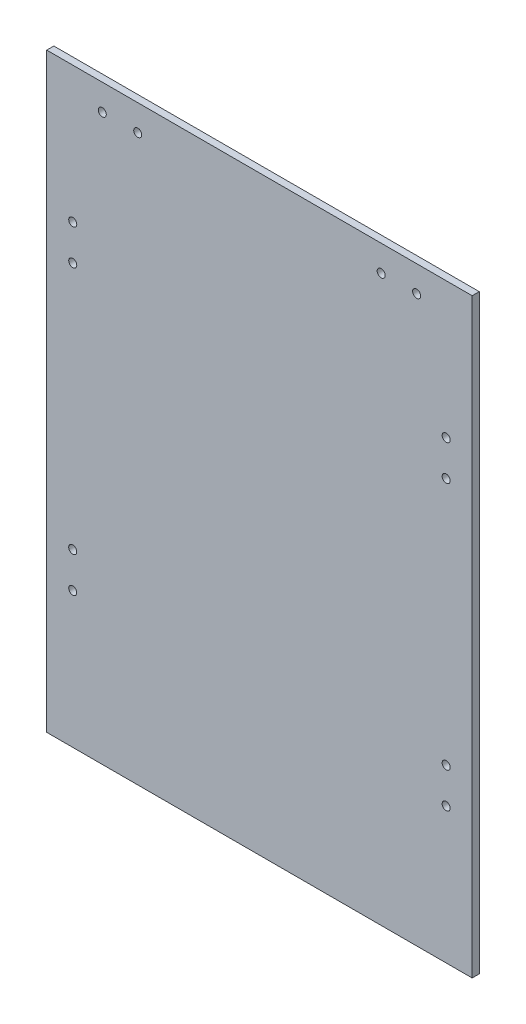
ISO-10303-21;
HEADER;
FILE_DESCRIPTION(('STEP AP214'),'2;1');
FILE_NAME('part.step','',(''),(''),'','','');
FILE_SCHEMA(('AUTOMOTIVE_DESIGN { 1 0 10303 214 1 1 1 1 }'));
ENDSEC;
DATA;
#1=APPLICATION_CONTEXT('core data for automotive mechanical design processes');
#2=APPLICATION_PROTOCOL_DEFINITION('international standard','automotive_design',2000,#1);
#3=PRODUCT_CONTEXT('',#1,'mechanical');
#4=PRODUCT('Part','Part','',(#3));
#5=PRODUCT_RELATED_PRODUCT_CATEGORY('part','',(#4));
#6=PRODUCT_DEFINITION_FORMATION('','',#4);
#7=PRODUCT_DEFINITION_CONTEXT('part definition',#1,'design');
#8=PRODUCT_DEFINITION('design','',#6,#7);
#9=PRODUCT_DEFINITION_SHAPE('','',#8);
#10=(LENGTH_UNIT() NAMED_UNIT(*) SI_UNIT(.MILLI.,.METRE.));
#11=(NAMED_UNIT(*) PLANE_ANGLE_UNIT() SI_UNIT($,.RADIAN.));
#12=(NAMED_UNIT(*) SI_UNIT($,.STERADIAN.) SOLID_ANGLE_UNIT());
#13=UNCERTAINTY_MEASURE_WITH_UNIT(LENGTH_MEASURE(1.E-05),#10,'distance_accuracy_value','');
#14=(GEOMETRIC_REPRESENTATION_CONTEXT(3) GLOBAL_UNCERTAINTY_ASSIGNED_CONTEXT((#13)) GLOBAL_UNIT_ASSIGNED_CONTEXT((#10,
#11,#12)) REPRESENTATION_CONTEXT('',''));
#15=CARTESIAN_POINT('',(0.,0.,0.));
#16=DIRECTION('',(0.,0.,1.));
#17=DIRECTION('',(1.,0.,0.));
#18=AXIS2_PLACEMENT_3D('',#15,#16,#17);
#19=CARTESIAN_POINT('',(-90.,-125.,1.5));
#20=DIRECTION('',(1.,0.,0.));
#21=DIRECTION('',(0.,0.,-1.));
#22=AXIS2_PLACEMENT_3D('',#19,#20,#21);
#23=PLANE('',#22);
#24=DIRECTION('',(0.,-1.,0.));
#25=VECTOR('',#24,1.);
#26=CARTESIAN_POINT('',(-90.,-125.,-1.5));
#27=LINE('',#26,#25);
#28=CARTESIAN_POINT('',(-90.,125.,-1.5));
#29=VERTEX_POINT('',#28);
#30=CARTESIAN_POINT('',(-90.,-125.,-1.5));
#31=VERTEX_POINT('',#30);
#32=EDGE_CURVE('E102',#29,#31,#27,.T.);
#33=ORIENTED_EDGE('',*,*,#32,.T.);
#34=DIRECTION('',(0.,0.,-1.));
#35=VECTOR('',#34,1.);
#36=CARTESIAN_POINT('',(-90.,-125.,1.5));
#37=LINE('',#36,#35);
#38=CARTESIAN_POINT('',(-90.,-125.,1.5));
#39=VERTEX_POINT('',#38);
#40=EDGE_CURVE('E11',#39,#31,#37,.T.);
#41=ORIENTED_EDGE('',*,*,#40,.F.);
#42=DIRECTION('',(0.,-1.,0.));
#43=VECTOR('',#42,1.);
#44=CARTESIAN_POINT('',(-90.,-125.,1.5));
#45=LINE('',#44,#43);
#46=CARTESIAN_POINT('',(-90.,125.,1.5));
#47=VERTEX_POINT('',#46);
#48=EDGE_CURVE('E90',#47,#39,#45,.T.);
#49=ORIENTED_EDGE('',*,*,#48,.F.);
#50=DIRECTION('',(0.,0.,-1.));
#51=VECTOR('',#50,1.);
#52=CARTESIAN_POINT('',(-90.,125.,1.5));
#53=LINE('',#52,#51);
#54=EDGE_CURVE('E98',#47,#29,#53,.T.);
#55=ORIENTED_EDGE('',*,*,#54,.T.);
#56=EDGE_LOOP('',(#33,#41,#49,#55));
#57=FACE_BOUND('',#56,.T.);
#58=ADVANCED_FACE('F39',(#57),#23,.F.);
#59=CARTESIAN_POINT('',(90.,-125.,1.5));
#60=DIRECTION('',(0.,1.,0.));
#61=DIRECTION('',(0.,0.,1.));
#62=AXIS2_PLACEMENT_3D('',#59,#60,#61);
#63=PLANE('',#62);
#64=DIRECTION('',(1.,0.,0.));
#65=VECTOR('',#64,1.);
#66=CARTESIAN_POINT('',(90.,-125.,-1.5));
#67=LINE('',#66,#65);
#68=CARTESIAN_POINT('',(90.,-125.,-1.5));
#69=VERTEX_POINT('',#68);
#70=EDGE_CURVE('E94',#31,#69,#67,.T.);
#71=ORIENTED_EDGE('',*,*,#70,.T.);
#72=DIRECTION('',(0.,0.,-1.));
#73=VECTOR('',#72,1.);
#74=CARTESIAN_POINT('',(90.,-125.,1.5));
#75=LINE('',#74,#73);
#76=CARTESIAN_POINT('',(90.,-125.,1.5));
#77=VERTEX_POINT('',#76);
#78=EDGE_CURVE('E47',#77,#69,#75,.T.);
#79=ORIENTED_EDGE('',*,*,#78,.F.);
#80=DIRECTION('',(1.,0.,0.));
#81=VECTOR('',#80,1.);
#82=CARTESIAN_POINT('',(90.,-125.,1.5));
#83=LINE('',#82,#81);
#84=EDGE_CURVE('E85',#39,#77,#83,.T.);
#85=ORIENTED_EDGE('',*,*,#84,.F.);
#86=ORIENTED_EDGE('',*,*,#40,.T.);
#87=EDGE_LOOP('',(#71,#79,#85,#86));
#88=FACE_BOUND('',#87,.T.);
#89=ADVANCED_FACE('F93',(#88),#63,.F.);
#90=CARTESIAN_POINT('',(90.,-125.,1.5));
#91=DIRECTION('',(-1.,0.,0.));
#92=DIRECTION('',(0.,-1.,0.));
#93=AXIS2_PLACEMENT_3D('',#90,#91,#92);
#94=PLANE('',#93);
#95=DIRECTION('',(0.,1.,0.));
#96=VECTOR('',#95,1.);
#97=CARTESIAN_POINT('',(90.,-125.,-1.5));
#98=LINE('',#97,#96);
#99=CARTESIAN_POINT('',(90.,125.,-1.5));
#100=VERTEX_POINT('',#99);
#101=EDGE_CURVE('E72',#69,#100,#98,.T.);
#102=ORIENTED_EDGE('',*,*,#101,.T.);
#103=DIRECTION('',(0.,0.,-1.));
#104=VECTOR('',#103,1.);
#105=CARTESIAN_POINT('',(90.,125.,1.5));
#106=LINE('',#105,#104);
#107=CARTESIAN_POINT('',(90.,125.,1.5));
#108=VERTEX_POINT('',#107);
#109=EDGE_CURVE('E95',#108,#100,#106,.T.);
#110=ORIENTED_EDGE('',*,*,#109,.F.);
#111=DIRECTION('',(0.,1.,0.));
#112=VECTOR('',#111,1.);
#113=CARTESIAN_POINT('',(90.,-125.,1.5));
#114=LINE('',#113,#112);
#115=EDGE_CURVE('E88',#77,#108,#114,.T.);
#116=ORIENTED_EDGE('',*,*,#115,.F.);
#117=ORIENTED_EDGE('',*,*,#78,.T.);
#118=EDGE_LOOP('',(#102,#110,#116,#117));
#119=FACE_BOUND('',#118,.T.);
#120=ADVANCED_FACE('F96',(#119),#94,.F.);
#121=CARTESIAN_POINT('',(90.,125.,1.5));
#122=DIRECTION('',(0.,-1.,0.));
#123=DIRECTION('',(1.,0.,0.));
#124=AXIS2_PLACEMENT_3D('',#121,#122,#123);
#125=PLANE('',#124);
#126=DIRECTION('',(-1.,0.,0.));
#127=VECTOR('',#126,1.);
#128=CARTESIAN_POINT('',(90.,125.,-1.5));
#129=LINE('',#128,#127);
#130=EDGE_CURVE('E78',#100,#29,#129,.T.);
#131=ORIENTED_EDGE('',*,*,#130,.T.);
#132=ORIENTED_EDGE('',*,*,#54,.F.);
#133=DIRECTION('',(-1.,0.,0.));
#134=VECTOR('',#133,1.);
#135=CARTESIAN_POINT('',(90.,125.,1.5));
#136=LINE('',#135,#134);
#137=EDGE_CURVE('E55',#108,#47,#136,.T.);
#138=ORIENTED_EDGE('',*,*,#137,.F.);
#139=ORIENTED_EDGE('',*,*,#109,.T.);
#140=EDGE_LOOP('',(#131,#132,#138,#139));
#141=FACE_BOUND('',#140,.T.);
#142=ADVANCED_FACE('F110',(#141),#125,.F.);
#143=CARTESIAN_POINT('',(0.,0.,1.5));
#144=DIRECTION('',(0.,0.,1.));
#145=DIRECTION('',(1.,0.,0.));
#146=AXIS2_PLACEMENT_3D('',#143,#144,#145);
#147=PLANE('',#146);
#148=CARTESIAN_POINT('',(-79.,52.5,1.5));
#149=DIRECTION('',(0.,0.,1.));
#150=DIRECTION('',(1.,0.,0.));
#151=AXIS2_PLACEMENT_3D('',#148,#149,#150);
#152=CIRCLE('',#151,1.7);
#153=CARTESIAN_POINT('',(-77.3,52.5,1.5));
#154=VERTEX_POINT('',#153);
#155=EDGE_CURVE('E143',#154,#154,#152,.T.);
#156=ORIENTED_EDGE('',*,*,#155,.F.);
#157=EDGE_LOOP('',(#156));
#158=FACE_BOUND('',#157,.T.);
#159=CARTESIAN_POINT('',(-78.9999999999999,-52.5,1.5));
#160=DIRECTION('',(0.,0.,1.));
#161=DIRECTION('',(-1.,0.,0.));
#162=AXIS2_PLACEMENT_3D('',#159,#160,#161);
#163=CIRCLE('',#162,1.7);
#164=CARTESIAN_POINT('',(-80.6999999999999,-52.5,1.5));
#165=VERTEX_POINT('',#164);
#166=EDGE_CURVE('E162',#165,#165,#163,.T.);
#167=ORIENTED_EDGE('',*,*,#166,.F.);
#168=EDGE_LOOP('',(#167));
#169=FACE_BOUND('',#168,.T.);
#170=CARTESIAN_POINT('',(-78.9999999999999,-67.5,1.5));
#171=DIRECTION('',(0.,0.,1.));
#172=DIRECTION('',(-1.,0.,0.));
#173=AXIS2_PLACEMENT_3D('',#170,#171,#172);
#174=CIRCLE('',#173,1.7);
#175=CARTESIAN_POINT('',(-80.6999999999999,-67.5,1.5));
#176=VERTEX_POINT('',#175);
#177=EDGE_CURVE('E156',#176,#176,#174,.T.);
#178=ORIENTED_EDGE('',*,*,#177,.F.);
#179=EDGE_LOOP('',(#178));
#180=FACE_BOUND('',#179,.T.);
#181=CARTESIAN_POINT('',(78.9999999999998,-67.5000000000001,1.5));
#182=DIRECTION('',(0.,0.,1.));
#183=DIRECTION('',(1.,0.,0.));
#184=AXIS2_PLACEMENT_3D('',#181,#182,#183);
#185=CIRCLE('',#184,1.69999999999999);
#186=CARTESIAN_POINT('',(80.6999999999998,-67.5000000000001,1.5));
#187=VERTEX_POINT('',#186);
#188=EDGE_CURVE('E149',#187,#187,#185,.T.);
#189=ORIENTED_EDGE('',*,*,#188,.F.);
#190=EDGE_LOOP('',(#189));
#191=FACE_BOUND('',#190,.T.);
#192=CARTESIAN_POINT('',(78.9999999999998,-52.5000000000001,1.5));
#193=DIRECTION('',(0.,0.,1.));
#194=DIRECTION('',(1.,0.,0.));
#195=AXIS2_PLACEMENT_3D('',#192,#193,#194);
#196=CIRCLE('',#195,1.7);
#197=CARTESIAN_POINT('',(80.6999999999998,-52.5000000000001,1.5));
#198=VERTEX_POINT('',#197);
#199=EDGE_CURVE('E150',#198,#198,#196,.T.);
#200=ORIENTED_EDGE('',*,*,#199,.F.);
#201=EDGE_LOOP('',(#200));
#202=FACE_BOUND('',#201,.T.);
#203=CARTESIAN_POINT('',(79.,52.4999999999999,1.5));
#204=DIRECTION('',(0.,0.,1.));
#205=DIRECTION('',(-1.,0.,0.));
#206=AXIS2_PLACEMENT_3D('',#203,#204,#205);
#207=CIRCLE('',#206,1.7);
#208=CARTESIAN_POINT('',(77.3,52.4999999999999,1.5));
#209=VERTEX_POINT('',#208);
#210=EDGE_CURVE('E179',#209,#209,#207,.T.);
#211=ORIENTED_EDGE('',*,*,#210,.F.);
#212=EDGE_LOOP('',(#211));
#213=FACE_BOUND('',#212,.T.);
#214=CARTESIAN_POINT('',(79.,67.4999999999999,1.5));
#215=DIRECTION('',(0.,0.,1.));
#216=DIRECTION('',(-1.,0.,0.));
#217=AXIS2_PLACEMENT_3D('',#214,#215,#216);
#218=CIRCLE('',#217,1.70000000000001);
#219=CARTESIAN_POINT('',(77.3,67.4999999999999,1.5));
#220=VERTEX_POINT('',#219);
#221=EDGE_CURVE('E173',#220,#220,#218,.T.);
#222=ORIENTED_EDGE('',*,*,#221,.F.);
#223=EDGE_LOOP('',(#222));
#224=FACE_BOUND('',#223,.T.);
#225=CARTESIAN_POINT('',(-79.,67.5,1.5));
#226=DIRECTION('',(0.,0.,1.));
#227=DIRECTION('',(1.,0.,0.));
#228=AXIS2_PLACEMENT_3D('',#225,#226,#227);
#229=CIRCLE('',#228,1.7);
#230=CARTESIAN_POINT('',(-77.3,67.5,1.5));
#231=VERTEX_POINT('',#230);
#232=EDGE_CURVE('E140',#231,#231,#229,.T.);
#233=ORIENTED_EDGE('',*,*,#232,.F.);
#234=EDGE_LOOP('',(#233));
#235=FACE_BOUND('',#234,.T.);
#236=CARTESIAN_POINT('',(66.5,114.,1.5));
#237=DIRECTION('',(0.,0.,1.));
#238=DIRECTION('',(-1.,0.,0.));
#239=AXIS2_PLACEMENT_3D('',#236,#237,#238);
#240=CIRCLE('',#239,1.70000000000001);
#241=CARTESIAN_POINT('',(64.8,114.,1.5));
#242=VERTEX_POINT('',#241);
#243=EDGE_CURVE('E125',#242,#242,#240,.T.);
#244=ORIENTED_EDGE('',*,*,#243,.F.);
#245=EDGE_LOOP('',(#244));
#246=FACE_BOUND('',#245,.T.);
#247=CARTESIAN_POINT('',(51.5,114.,1.5));
#248=DIRECTION('',(0.,0.,1.));
#249=DIRECTION('',(-1.,0.,0.));
#250=AXIS2_PLACEMENT_3D('',#247,#248,#249);
#251=CIRCLE('',#250,1.70000000000001);
#252=CARTESIAN_POINT('',(49.8,114.,1.5));
#253=VERTEX_POINT('',#252);
#254=EDGE_CURVE('E132',#253,#253,#251,.T.);
#255=ORIENTED_EDGE('',*,*,#254,.F.);
#256=EDGE_LOOP('',(#255));
#257=FACE_BOUND('',#256,.T.);
#258=CARTESIAN_POINT('',(-66.5,114.,1.5));
#259=DIRECTION('',(0.,0.,1.));
#260=DIRECTION('',(1.,0.,0.));
#261=AXIS2_PLACEMENT_3D('',#258,#259,#260);
#262=CIRCLE('',#261,1.70000000000001);
#263=CARTESIAN_POINT('',(-64.8,114.,1.5));
#264=VERTEX_POINT('',#263);
#265=EDGE_CURVE('E119',#264,#264,#262,.T.);
#266=ORIENTED_EDGE('',*,*,#265,.F.);
#267=EDGE_LOOP('',(#266));
#268=FACE_BOUND('',#267,.T.);
#269=CARTESIAN_POINT('',(-51.5,114.,1.5));
#270=DIRECTION('',(0.,0.,1.));
#271=DIRECTION('',(1.,0.,0.));
#272=AXIS2_PLACEMENT_3D('',#269,#270,#271);
#273=CIRCLE('',#272,1.70000000000001);
#274=CARTESIAN_POINT('',(-49.8,114.,1.5));
#275=VERTEX_POINT('',#274);
#276=EDGE_CURVE('E116',#275,#275,#273,.T.);
#277=ORIENTED_EDGE('',*,*,#276,.F.);
#278=EDGE_LOOP('',(#277));
#279=FACE_BOUND('',#278,.T.);
#280=ORIENTED_EDGE('',*,*,#48,.T.);
#281=ORIENTED_EDGE('',*,*,#84,.T.);
#282=ORIENTED_EDGE('',*,*,#115,.T.);
#283=ORIENTED_EDGE('',*,*,#137,.T.);
#284=EDGE_LOOP('',(#280,#281,#282,#283));
#285=FACE_BOUND('',#284,.T.);
#286=ADVANCED_FACE('F86',(#158,#169,#180,#191,#202,#213,#224,#235,#246,#257,#268,#279,#285),
#147,.T.);
#287=CARTESIAN_POINT('',(0.,0.,-1.5));
#288=DIRECTION('',(0.,0.,1.));
#289=DIRECTION('',(1.,0.,0.));
#290=AXIS2_PLACEMENT_3D('',#287,#288,#289);
#291=PLANE('',#290);
#292=CARTESIAN_POINT('',(-79.,52.5,-1.5));
#293=DIRECTION('',(0.,0.,1.));
#294=DIRECTION('',(1.,0.,0.));
#295=AXIS2_PLACEMENT_3D('',#292,#293,#294);
#296=CIRCLE('',#295,1.7);
#297=CARTESIAN_POINT('',(-77.3,52.5,-1.5));
#298=VERTEX_POINT('',#297);
#299=EDGE_CURVE('E165',#298,#298,#296,.T.);
#300=ORIENTED_EDGE('',*,*,#299,.T.);
#301=EDGE_LOOP('',(#300));
#302=FACE_BOUND('',#301,.T.);
#303=CARTESIAN_POINT('',(-78.9999999999999,-52.5,-1.5));
#304=DIRECTION('',(0.,0.,1.));
#305=DIRECTION('',(-1.,0.,0.));
#306=AXIS2_PLACEMENT_3D('',#303,#304,#305);
#307=CIRCLE('',#306,1.7);
#308=CARTESIAN_POINT('',(-80.6999999999999,-52.5,-1.5));
#309=VERTEX_POINT('',#308);
#310=EDGE_CURVE('E159',#309,#309,#307,.T.);
#311=ORIENTED_EDGE('',*,*,#310,.T.);
#312=EDGE_LOOP('',(#311));
#313=FACE_BOUND('',#312,.T.);
#314=CARTESIAN_POINT('',(-78.9999999999999,-67.5,-1.5));
#315=DIRECTION('',(0.,0.,1.));
#316=DIRECTION('',(-1.,0.,0.));
#317=AXIS2_PLACEMENT_3D('',#314,#315,#316);
#318=CIRCLE('',#317,1.7);
#319=CARTESIAN_POINT('',(-80.6999999999999,-67.5,-1.5));
#320=VERTEX_POINT('',#319);
#321=EDGE_CURVE('E153',#320,#320,#318,.T.);
#322=ORIENTED_EDGE('',*,*,#321,.T.);
#323=EDGE_LOOP('',(#322));
#324=FACE_BOUND('',#323,.T.);
#325=CARTESIAN_POINT('',(78.9999999999998,-67.5000000000001,-1.5));
#326=DIRECTION('',(0.,0.,1.));
#327=DIRECTION('',(1.,0.,0.));
#328=AXIS2_PLACEMENT_3D('',#325,#326,#327);
#329=CIRCLE('',#328,1.69999999999999);
#330=CARTESIAN_POINT('',(80.6999999999998,-67.5000000000001,-1.5));
#331=VERTEX_POINT('',#330);
#332=EDGE_CURVE('E146',#331,#331,#329,.T.);
#333=ORIENTED_EDGE('',*,*,#332,.T.);
#334=EDGE_LOOP('',(#333));
#335=FACE_BOUND('',#334,.T.);
#336=CARTESIAN_POINT('',(78.9999999999998,-52.5000000000001,-1.5));
#337=DIRECTION('',(0.,0.,1.));
#338=DIRECTION('',(1.,0.,0.));
#339=AXIS2_PLACEMENT_3D('',#336,#337,#338);
#340=CIRCLE('',#339,1.7);
#341=CARTESIAN_POINT('',(80.6999999999998,-52.5000000000001,-1.5));
#342=VERTEX_POINT('',#341);
#343=EDGE_CURVE('E182',#342,#342,#340,.T.);
#344=ORIENTED_EDGE('',*,*,#343,.T.);
#345=EDGE_LOOP('',(#344));
#346=FACE_BOUND('',#345,.T.);
#347=CARTESIAN_POINT('',(79.,52.4999999999999,-1.5));
#348=DIRECTION('',(0.,0.,1.));
#349=DIRECTION('',(-1.,0.,0.));
#350=AXIS2_PLACEMENT_3D('',#347,#348,#349);
#351=CIRCLE('',#350,1.7);
#352=CARTESIAN_POINT('',(77.3,52.4999999999999,-1.5));
#353=VERTEX_POINT('',#352);
#354=EDGE_CURVE('E176',#353,#353,#351,.T.);
#355=ORIENTED_EDGE('',*,*,#354,.T.);
#356=EDGE_LOOP('',(#355));
#357=FACE_BOUND('',#356,.T.);
#358=CARTESIAN_POINT('',(79.,67.4999999999999,-1.5));
#359=DIRECTION('',(0.,0.,1.));
#360=DIRECTION('',(-1.,0.,0.));
#361=AXIS2_PLACEMENT_3D('',#358,#359,#360);
#362=CIRCLE('',#361,1.70000000000001);
#363=CARTESIAN_POINT('',(77.3,67.4999999999999,-1.5));
#364=VERTEX_POINT('',#363);
#365=EDGE_CURVE('E170',#364,#364,#362,.T.);
#366=ORIENTED_EDGE('',*,*,#365,.T.);
#367=EDGE_LOOP('',(#366));
#368=FACE_BOUND('',#367,.T.);
#369=CARTESIAN_POINT('',(-79.,67.5,-1.5));
#370=DIRECTION('',(0.,0.,1.));
#371=DIRECTION('',(1.,0.,0.));
#372=AXIS2_PLACEMENT_3D('',#369,#370,#371);
#373=CIRCLE('',#372,1.7);
#374=CARTESIAN_POINT('',(-77.3,67.5,-1.5));
#375=VERTEX_POINT('',#374);
#376=EDGE_CURVE('E126',#375,#375,#373,.T.);
#377=ORIENTED_EDGE('',*,*,#376,.T.);
#378=EDGE_LOOP('',(#377));
#379=FACE_BOUND('',#378,.T.);
#380=CARTESIAN_POINT('',(66.5,114.,-1.5));
#381=DIRECTION('',(0.,0.,1.));
#382=DIRECTION('',(-1.,0.,0.));
#383=AXIS2_PLACEMENT_3D('',#380,#381,#382);
#384=CIRCLE('',#383,1.70000000000001);
#385=CARTESIAN_POINT('',(64.8,114.,-1.5));
#386=VERTEX_POINT('',#385);
#387=EDGE_CURVE('E122',#386,#386,#384,.T.);
#388=ORIENTED_EDGE('',*,*,#387,.T.);
#389=EDGE_LOOP('',(#388));
#390=FACE_BOUND('',#389,.T.);
#391=CARTESIAN_POINT('',(51.5,114.,-1.5));
#392=DIRECTION('',(0.,0.,1.));
#393=DIRECTION('',(-1.,0.,0.));
#394=AXIS2_PLACEMENT_3D('',#391,#392,#393);
#395=CIRCLE('',#394,1.70000000000001);
#396=CARTESIAN_POINT('',(49.8,114.,-1.5));
#397=VERTEX_POINT('',#396);
#398=EDGE_CURVE('E129',#397,#397,#395,.T.);
#399=ORIENTED_EDGE('',*,*,#398,.T.);
#400=EDGE_LOOP('',(#399));
#401=FACE_BOUND('',#400,.T.);
#402=CARTESIAN_POINT('',(-66.5,114.,-1.5));
#403=DIRECTION('',(0.,0.,1.));
#404=DIRECTION('',(1.,0.,0.));
#405=AXIS2_PLACEMENT_3D('',#402,#403,#404);
#406=CIRCLE('',#405,1.70000000000001);
#407=CARTESIAN_POINT('',(-64.8,114.,-1.5));
#408=VERTEX_POINT('',#407);
#409=EDGE_CURVE('E135',#408,#408,#406,.T.);
#410=ORIENTED_EDGE('',*,*,#409,.T.);
#411=EDGE_LOOP('',(#410));
#412=FACE_BOUND('',#411,.T.);
#413=CARTESIAN_POINT('',(-51.5,114.,-1.5));
#414=DIRECTION('',(0.,0.,1.));
#415=DIRECTION('',(1.,0.,0.));
#416=AXIS2_PLACEMENT_3D('',#413,#414,#415);
#417=CIRCLE('',#416,1.70000000000001);
#418=CARTESIAN_POINT('',(-49.8,114.,-1.5));
#419=VERTEX_POINT('',#418);
#420=EDGE_CURVE('E105',#419,#419,#417,.T.);
#421=ORIENTED_EDGE('',*,*,#420,.T.);
#422=EDGE_LOOP('',(#421));
#423=FACE_BOUND('',#422,.T.);
#424=ORIENTED_EDGE('',*,*,#32,.F.);
#425=ORIENTED_EDGE('',*,*,#130,.F.);
#426=ORIENTED_EDGE('',*,*,#101,.F.);
#427=ORIENTED_EDGE('',*,*,#70,.F.);
#428=EDGE_LOOP('',(#424,#425,#426,#427));
#429=FACE_BOUND('',#428,.T.);
#430=ADVANCED_FACE('F113',(#302,#313,#324,#335,#346,#357,#368,#379,#390,#401,#412,#423,#429),
#291,.F.);
#431=CARTESIAN_POINT('',(-51.5,114.,-1.5));
#432=DIRECTION('',(0.,0.,1.));
#433=DIRECTION('',(1.,0.,0.));
#434=AXIS2_PLACEMENT_3D('',#431,#432,#433);
#435=CYLINDRICAL_SURFACE('',#434,1.70000000000001);
#436=ORIENTED_EDGE('',*,*,#420,.F.);
#437=EDGE_LOOP('',(#436));
#438=FACE_BOUND('',#437,.T.);
#439=ORIENTED_EDGE('',*,*,#276,.T.);
#440=EDGE_LOOP('',(#439));
#441=FACE_BOUND('',#440,.T.);
#442=ADVANCED_FACE('F208',(#438,#441),#435,.F.);
#443=CARTESIAN_POINT('',(-66.5,114.,-1.5));
#444=DIRECTION('',(0.,0.,1.));
#445=DIRECTION('',(1.,0.,0.));
#446=AXIS2_PLACEMENT_3D('',#443,#444,#445);
#447=CYLINDRICAL_SURFACE('',#446,1.70000000000001);
#448=ORIENTED_EDGE('',*,*,#409,.F.);
#449=EDGE_LOOP('',(#448));
#450=FACE_BOUND('',#449,.T.);
#451=ORIENTED_EDGE('',*,*,#265,.T.);
#452=EDGE_LOOP('',(#451));
#453=FACE_BOUND('',#452,.T.);
#454=ADVANCED_FACE('F210',(#450,#453),#447,.F.);
#455=CARTESIAN_POINT('',(51.5,114.,-1.5));
#456=DIRECTION('',(0.,0.,1.));
#457=DIRECTION('',(1.,0.,0.));
#458=AXIS2_PLACEMENT_3D('',#455,#456,#457);
#459=CYLINDRICAL_SURFACE('',#458,1.70000000000001);
#460=ORIENTED_EDGE('',*,*,#398,.F.);
#461=EDGE_LOOP('',(#460));
#462=FACE_BOUND('',#461,.T.);
#463=ORIENTED_EDGE('',*,*,#254,.T.);
#464=EDGE_LOOP('',(#463));
#465=FACE_BOUND('',#464,.T.);
#466=ADVANCED_FACE('F217',(#462,#465),#459,.F.);
#467=CARTESIAN_POINT('',(66.5,114.,-1.5));
#468=DIRECTION('',(0.,0.,1.));
#469=DIRECTION('',(1.,0.,0.));
#470=AXIS2_PLACEMENT_3D('',#467,#468,#469);
#471=CYLINDRICAL_SURFACE('',#470,1.70000000000001);
#472=ORIENTED_EDGE('',*,*,#387,.F.);
#473=EDGE_LOOP('',(#472));
#474=FACE_BOUND('',#473,.T.);
#475=ORIENTED_EDGE('',*,*,#243,.T.);
#476=EDGE_LOOP('',(#475));
#477=FACE_BOUND('',#476,.T.);
#478=ADVANCED_FACE('F278',(#474,#477),#471,.F.);
#479=CARTESIAN_POINT('',(-79.,67.5,-1.5));
#480=DIRECTION('',(0.,0.,1.));
#481=DIRECTION('',(1.,0.,0.));
#482=AXIS2_PLACEMENT_3D('',#479,#480,#481);
#483=CYLINDRICAL_SURFACE('',#482,1.7);
#484=ORIENTED_EDGE('',*,*,#376,.F.);
#485=EDGE_LOOP('',(#484));
#486=FACE_BOUND('',#485,.T.);
#487=ORIENTED_EDGE('',*,*,#232,.T.);
#488=EDGE_LOOP('',(#487));
#489=FACE_BOUND('',#488,.T.);
#490=ADVANCED_FACE('F287',(#486,#489),#483,.F.);
#491=CARTESIAN_POINT('',(79.,67.4999999999999,-1.5));
#492=DIRECTION('',(0.,0.,1.));
#493=DIRECTION('',(1.,0.,0.));
#494=AXIS2_PLACEMENT_3D('',#491,#492,#493);
#495=CYLINDRICAL_SURFACE('',#494,1.70000000000001);
#496=ORIENTED_EDGE('',*,*,#365,.F.);
#497=EDGE_LOOP('',(#496));
#498=FACE_BOUND('',#497,.T.);
#499=ORIENTED_EDGE('',*,*,#221,.T.);
#500=EDGE_LOOP('',(#499));
#501=FACE_BOUND('',#500,.T.);
#502=ADVANCED_FACE('F295',(#498,#501),#495,.F.);
#503=CARTESIAN_POINT('',(79.,52.4999999999999,-1.5));
#504=DIRECTION('',(0.,0.,1.));
#505=DIRECTION('',(1.,0.,0.));
#506=AXIS2_PLACEMENT_3D('',#503,#504,#505);
#507=CYLINDRICAL_SURFACE('',#506,1.7);
#508=ORIENTED_EDGE('',*,*,#354,.F.);
#509=EDGE_LOOP('',(#508));
#510=FACE_BOUND('',#509,.T.);
#511=ORIENTED_EDGE('',*,*,#210,.T.);
#512=EDGE_LOOP('',(#511));
#513=FACE_BOUND('',#512,.T.);
#514=ADVANCED_FACE('F304',(#510,#513),#507,.F.);
#515=CARTESIAN_POINT('',(78.9999999999998,-52.5000000000001,-1.5));
#516=DIRECTION('',(0.,0.,1.));
#517=DIRECTION('',(1.,0.,0.));
#518=AXIS2_PLACEMENT_3D('',#515,#516,#517);
#519=CYLINDRICAL_SURFACE('',#518,1.7);
#520=ORIENTED_EDGE('',*,*,#343,.F.);
#521=EDGE_LOOP('',(#520));
#522=FACE_BOUND('',#521,.T.);
#523=ORIENTED_EDGE('',*,*,#199,.T.);
#524=EDGE_LOOP('',(#523));
#525=FACE_BOUND('',#524,.T.);
#526=ADVANCED_FACE('F188',(#522,#525),#519,.F.);
#527=CARTESIAN_POINT('',(78.9999999999998,-67.5000000000001,-1.5));
#528=DIRECTION('',(0.,0.,1.));
#529=DIRECTION('',(1.,0.,0.));
#530=AXIS2_PLACEMENT_3D('',#527,#528,#529);
#531=CYLINDRICAL_SURFACE('',#530,1.69999999999999);
#532=ORIENTED_EDGE('',*,*,#332,.F.);
#533=EDGE_LOOP('',(#532));
#534=FACE_BOUND('',#533,.T.);
#535=ORIENTED_EDGE('',*,*,#188,.T.);
#536=EDGE_LOOP('',(#535));
#537=FACE_BOUND('',#536,.T.);
#538=ADVANCED_FACE('F321',(#534,#537),#531,.F.);
#539=CARTESIAN_POINT('',(-78.9999999999999,-67.5,-1.5));
#540=DIRECTION('',(0.,0.,1.));
#541=DIRECTION('',(1.,0.,0.));
#542=AXIS2_PLACEMENT_3D('',#539,#540,#541);
#543=CYLINDRICAL_SURFACE('',#542,1.7);
#544=ORIENTED_EDGE('',*,*,#321,.F.);
#545=EDGE_LOOP('',(#544));
#546=FACE_BOUND('',#545,.T.);
#547=ORIENTED_EDGE('',*,*,#177,.T.);
#548=EDGE_LOOP('',(#547));
#549=FACE_BOUND('',#548,.T.);
#550=ADVANCED_FACE('F330',(#546,#549),#543,.F.);
#551=CARTESIAN_POINT('',(-78.9999999999999,-52.5,-1.5));
#552=DIRECTION('',(0.,0.,1.));
#553=DIRECTION('',(1.,0.,0.));
#554=AXIS2_PLACEMENT_3D('',#551,#552,#553);
#555=CYLINDRICAL_SURFACE('',#554,1.7);
#556=ORIENTED_EDGE('',*,*,#310,.F.);
#557=EDGE_LOOP('',(#556));
#558=FACE_BOUND('',#557,.T.);
#559=ORIENTED_EDGE('',*,*,#166,.T.);
#560=EDGE_LOOP('',(#559));
#561=FACE_BOUND('',#560,.T.);
#562=ADVANCED_FACE('F339',(#558,#561),#555,.F.);
#563=CARTESIAN_POINT('',(-79.,52.5,-1.5));
#564=DIRECTION('',(0.,0.,1.));
#565=DIRECTION('',(1.,0.,0.));
#566=AXIS2_PLACEMENT_3D('',#563,#564,#565);
#567=CYLINDRICAL_SURFACE('',#566,1.7);
#568=ORIENTED_EDGE('',*,*,#299,.F.);
#569=EDGE_LOOP('',(#568));
#570=FACE_BOUND('',#569,.T.);
#571=ORIENTED_EDGE('',*,*,#155,.T.);
#572=EDGE_LOOP('',(#571));
#573=FACE_BOUND('',#572,.T.);
#574=ADVANCED_FACE('F348',(#570,#573),#567,.F.);
#575=CLOSED_SHELL('',(#58,#89,#120,#142,#286,#430,#442,#454,#466,#478,#490,#502,#514,#526,#538,
#550,#562,#574));
#576=MANIFOLD_SOLID_BREP('B2',#575);
#577=ADVANCED_BREP_SHAPE_REPRESENTATION('',(#18,#576),#14);
#578=SHAPE_DEFINITION_REPRESENTATION(#9,#577);
ENDSEC;
END-ISO-10303-21;
